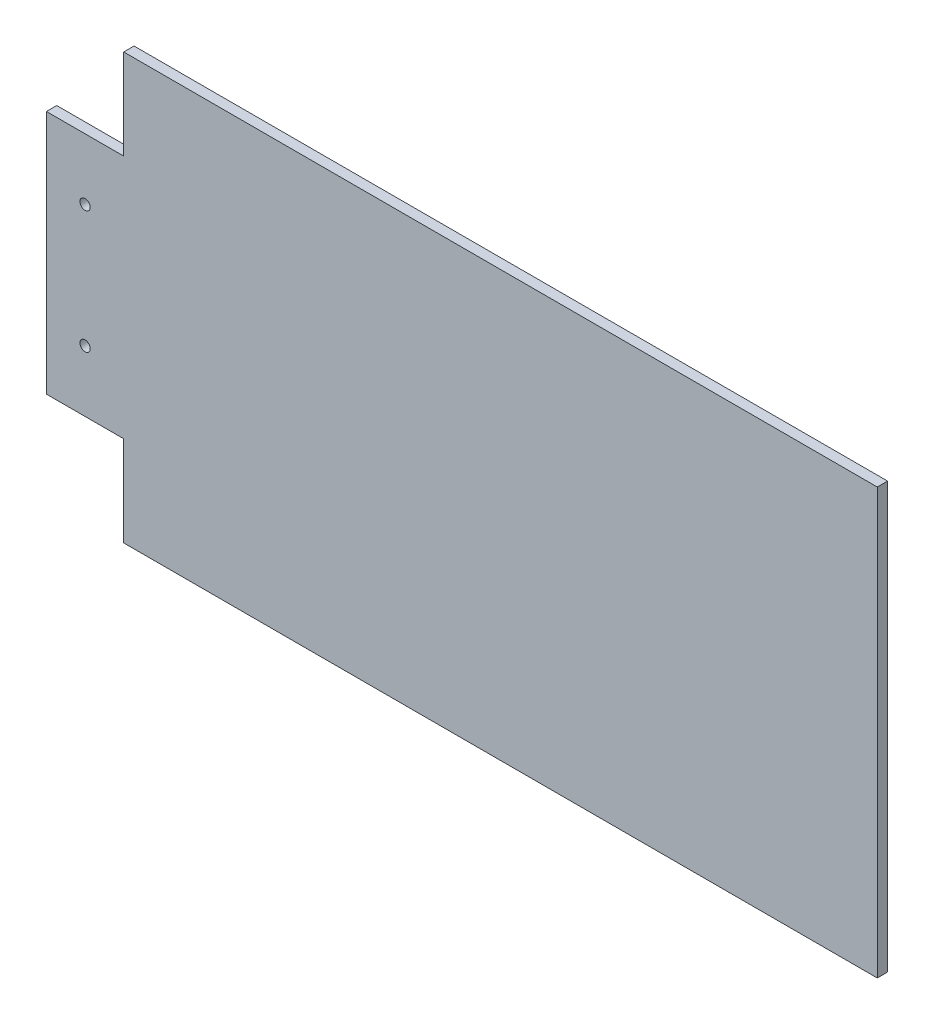
ISO-10303-21;
HEADER;
FILE_DESCRIPTION(('STEP AP214'),'2;1');
FILE_NAME('part.step','',(''),(''),'','','');
FILE_SCHEMA(('AUTOMOTIVE_DESIGN { 1 0 10303 214 1 1 1 1 }'));
ENDSEC;
DATA;
#1=APPLICATION_CONTEXT('core data for automotive mechanical design processes');
#2=APPLICATION_PROTOCOL_DEFINITION('international standard','automotive_design',2000,#1);
#3=PRODUCT_CONTEXT('',#1,'mechanical');
#4=PRODUCT('Part','Part','',(#3));
#5=PRODUCT_RELATED_PRODUCT_CATEGORY('part','',(#4));
#6=PRODUCT_DEFINITION_FORMATION('','',#4);
#7=PRODUCT_DEFINITION_CONTEXT('part definition',#1,'design');
#8=PRODUCT_DEFINITION('design','',#6,#7);
#9=PRODUCT_DEFINITION_SHAPE('','',#8);
#10=(LENGTH_UNIT() NAMED_UNIT(*) SI_UNIT(.MILLI.,.METRE.));
#11=(NAMED_UNIT(*) PLANE_ANGLE_UNIT() SI_UNIT($,.RADIAN.));
#12=(NAMED_UNIT(*) SI_UNIT($,.STERADIAN.) SOLID_ANGLE_UNIT());
#13=UNCERTAINTY_MEASURE_WITH_UNIT(LENGTH_MEASURE(1.E-05),#10,'distance_accuracy_value','');
#14=(GEOMETRIC_REPRESENTATION_CONTEXT(3) GLOBAL_UNCERTAINTY_ASSIGNED_CONTEXT((#13)) GLOBAL_UNIT_ASSIGNED_CONTEXT((#10,
#11,#12)) REPRESENTATION_CONTEXT('',''));
#15=CARTESIAN_POINT('',(0.,0.,0.));
#16=DIRECTION('',(0.,0.,1.));
#17=DIRECTION('',(1.,0.,0.));
#18=AXIS2_PLACEMENT_3D('',#15,#16,#17);
#19=CARTESIAN_POINT('',(0.,0.,4.));
#20=DIRECTION('',(0.,0.,-1.));
#21=DIRECTION('',(-1.,0.,0.));
#22=AXIS2_PLACEMENT_3D('',#19,#20,#21);
#23=PLANE('',#22);
#24=DIRECTION('',(0.,-1.,0.));
#25=VECTOR('',#24,1.);
#26=CARTESIAN_POINT('',(1290.34849584786,1172.22119055081,4.));
#27=LINE('',#26,#25);
#28=CARTESIAN_POINT('',(1290.34849584786,1267.22119061731,4.));
#29=VERTEX_POINT('',#28);
#30=CARTESIAN_POINT('',(1290.34849584786,1172.22119055081,4.));
#31=VERTEX_POINT('',#30);
#32=EDGE_CURVE('E151',#29,#31,#27,.T.);
#33=ORIENTED_EDGE('',*,*,#32,.T.);
#34=DIRECTION('',(1.,0.,0.));
#35=VECTOR('',#34,1.);
#36=CARTESIAN_POINT('',(1290.34849584786,1172.22119055081,4.));
#37=LINE('',#36,#35);
#38=CARTESIAN_POINT('',(1320.34849584661,1172.22119055081,4.));
#39=VERTEX_POINT('',#38);
#40=EDGE_CURVE('E99',#31,#39,#37,.T.);
#41=ORIENTED_EDGE('',*,*,#40,.T.);
#42=DIRECTION('',(0.,-1.,0.));
#43=VECTOR('',#42,1.);
#44=CARTESIAN_POINT('',(1320.34849584661,1172.22119055081,4.));
#45=LINE('',#44,#43);
#46=CARTESIAN_POINT('',(1320.34849584661,1137.22119055081,4.));
#47=VERTEX_POINT('',#46);
#48=EDGE_CURVE('E166',#39,#47,#45,.T.);
#49=ORIENTED_EDGE('',*,*,#48,.T.);
#50=DIRECTION('',(1.,0.,0.));
#51=VECTOR('',#50,1.);
#52=CARTESIAN_POINT('',(1612.7484958616,1137.22119055081,4.));
#53=LINE('',#52,#51);
#54=CARTESIAN_POINT('',(1612.7484958616,1137.22119055081,4.));
#55=VERTEX_POINT('',#54);
#56=EDGE_CURVE('E179',#47,#55,#53,.T.);
#57=ORIENTED_EDGE('',*,*,#56,.T.);
#58=DIRECTION('',(0.,1.,0.));
#59=VECTOR('',#58,1.);
#60=CARTESIAN_POINT('',(1612.7484958616,1302.22119077438,4.));
#61=LINE('',#60,#59);
#62=CARTESIAN_POINT('',(1612.7484958616,1302.22119077438,4.));
#63=VERTEX_POINT('',#62);
#64=EDGE_CURVE('E118',#55,#63,#61,.T.);
#65=ORIENTED_EDGE('',*,*,#64,.T.);
#66=DIRECTION('',(-1.,0.,0.));
#67=VECTOR('',#66,1.);
#68=CARTESIAN_POINT('',(1320.34849584661,1302.22119077438,4.));
#69=LINE('',#68,#67);
#70=CARTESIAN_POINT('',(1320.34849584661,1302.22119077438,4.));
#71=VERTEX_POINT('',#70);
#72=EDGE_CURVE('E112',#63,#71,#69,.T.);
#73=ORIENTED_EDGE('',*,*,#72,.T.);
#74=DIRECTION('',(0.,-1.,0.));
#75=VECTOR('',#74,1.);
#76=CARTESIAN_POINT('',(1320.34849584661,1267.22119061731,4.));
#77=LINE('',#76,#75);
#78=CARTESIAN_POINT('',(1320.34849584661,1267.22119061731,4.));
#79=VERTEX_POINT('',#78);
#80=EDGE_CURVE('E116',#71,#79,#77,.T.);
#81=ORIENTED_EDGE('',*,*,#80,.T.);
#82=DIRECTION('',(-1.,0.,0.));
#83=VECTOR('',#82,1.);
#84=CARTESIAN_POINT('',(1290.34849584786,1267.22119061731,4.));
#85=LINE('',#84,#83);
#86=EDGE_CURVE('E56',#79,#29,#85,.T.);
#87=ORIENTED_EDGE('',*,*,#86,.T.);
#88=EDGE_LOOP('',(#33,#41,#49,#57,#65,#73,#81,#87));
#89=FACE_BOUND('',#88,.T.);
#90=CARTESIAN_POINT('',(1305.34852033572,1243.47119063586,4.));
#91=DIRECTION('',(0.,0.,1.));
#92=DIRECTION('',(1.,0.,0.));
#93=AXIS2_PLACEMENT_3D('',#90,#91,#92);
#94=CIRCLE('',#93,2.0000000000001);
#95=CARTESIAN_POINT('',(1307.34852033572,1243.47119063586,4.));
#96=VERTEX_POINT('',#95);
#97=EDGE_CURVE('E140',#96,#96,#94,.T.);
#98=ORIENTED_EDGE('',*,*,#97,.F.);
#99=EDGE_LOOP('',(#98));
#100=FACE_BOUND('',#99,.T.);
#101=CARTESIAN_POINT('',(1305.34852033584,1195.97119068233,4.));
#102=DIRECTION('',(0.,0.,1.));
#103=DIRECTION('',(1.,0.,0.));
#104=AXIS2_PLACEMENT_3D('',#101,#102,#103);
#105=CIRCLE('',#104,2.0000000000001);
#106=CARTESIAN_POINT('',(1307.34852033584,1195.97119068233,4.));
#107=VERTEX_POINT('',#106);
#108=EDGE_CURVE('E188',#107,#107,#105,.T.);
#109=ORIENTED_EDGE('',*,*,#108,.F.);
#110=EDGE_LOOP('',(#109));
#111=FACE_BOUND('',#110,.T.);
#112=ADVANCED_FACE('F39',(#89,#100,#111),#23,.F.);
#113=CARTESIAN_POINT('',(0.,0.,0.));
#114=DIRECTION('',(0.,0.,-1.));
#115=DIRECTION('',(-1.,0.,0.));
#116=AXIS2_PLACEMENT_3D('',#113,#114,#115);
#117=PLANE('',#116);
#118=CARTESIAN_POINT('',(1305.34852033572,1243.47119063586,0.));
#119=DIRECTION('',(0.,0.,1.));
#120=DIRECTION('',(1.,0.,0.));
#121=AXIS2_PLACEMENT_3D('',#118,#119,#120);
#122=CIRCLE('',#121,2.0000000000001);
#123=CARTESIAN_POINT('',(1307.34852033572,1243.47119063586,0.));
#124=VERTEX_POINT('',#123);
#125=EDGE_CURVE('E185',#124,#124,#122,.T.);
#126=ORIENTED_EDGE('',*,*,#125,.T.);
#127=EDGE_LOOP('',(#126));
#128=FACE_BOUND('',#127,.T.);
#129=DIRECTION('',(0.,-1.,0.));
#130=VECTOR('',#129,1.);
#131=CARTESIAN_POINT('',(1290.34849584786,1172.22119055081,0.));
#132=LINE('',#131,#130);
#133=CARTESIAN_POINT('',(1290.34849584786,1267.22119061731,0.));
#134=VERTEX_POINT('',#133);
#135=CARTESIAN_POINT('',(1290.34849584786,1172.22119055081,0.));
#136=VERTEX_POINT('',#135);
#137=EDGE_CURVE('E136',#134,#136,#132,.T.);
#138=ORIENTED_EDGE('',*,*,#137,.F.);
#139=DIRECTION('',(-1.,0.,0.));
#140=VECTOR('',#139,1.);
#141=CARTESIAN_POINT('',(1290.34849584786,1267.22119061731,0.));
#142=LINE('',#141,#140);
#143=CARTESIAN_POINT('',(1320.34849584661,1267.22119061731,0.));
#144=VERTEX_POINT('',#143);
#145=EDGE_CURVE('E91',#144,#134,#142,.T.);
#146=ORIENTED_EDGE('',*,*,#145,.F.);
#147=DIRECTION('',(0.,-1.,0.));
#148=VECTOR('',#147,1.);
#149=CARTESIAN_POINT('',(1320.34849584661,1267.22119061731,0.));
#150=LINE('',#149,#148);
#151=CARTESIAN_POINT('',(1320.34849584661,1302.22119077438,0.));
#152=VERTEX_POINT('',#151);
#153=EDGE_CURVE('E85',#152,#144,#150,.T.);
#154=ORIENTED_EDGE('',*,*,#153,.F.);
#155=DIRECTION('',(-1.,0.,0.));
#156=VECTOR('',#155,1.);
#157=CARTESIAN_POINT('',(1320.34849584661,1302.22119077438,0.));
#158=LINE('',#157,#156);
#159=CARTESIAN_POINT('',(1612.7484958616,1302.22119077438,0.));
#160=VERTEX_POINT('',#159);
#161=EDGE_CURVE('E126',#160,#152,#158,.T.);
#162=ORIENTED_EDGE('',*,*,#161,.F.);
#163=DIRECTION('',(0.,1.,0.));
#164=VECTOR('',#163,1.);
#165=CARTESIAN_POINT('',(1612.7484958616,1302.22119077438,0.));
#166=LINE('',#165,#164);
#167=CARTESIAN_POINT('',(1612.7484958616,1137.22119055081,0.));
#168=VERTEX_POINT('',#167);
#169=EDGE_CURVE('E146',#168,#160,#166,.T.);
#170=ORIENTED_EDGE('',*,*,#169,.F.);
#171=DIRECTION('',(1.,0.,0.));
#172=VECTOR('',#171,1.);
#173=CARTESIAN_POINT('',(1612.7484958616,1137.22119055081,0.));
#174=LINE('',#173,#172);
#175=CARTESIAN_POINT('',(1320.34849584661,1137.22119055081,0.));
#176=VERTEX_POINT('',#175);
#177=EDGE_CURVE('E144',#176,#168,#174,.T.);
#178=ORIENTED_EDGE('',*,*,#177,.F.);
#179=DIRECTION('',(0.,-1.,0.));
#180=VECTOR('',#179,1.);
#181=CARTESIAN_POINT('',(1320.34849584661,1172.22119055081,0.));
#182=LINE('',#181,#180);
#183=CARTESIAN_POINT('',(1320.34849584661,1172.22119055081,0.));
#184=VERTEX_POINT('',#183);
#185=EDGE_CURVE('E142',#184,#176,#182,.T.);
#186=ORIENTED_EDGE('',*,*,#185,.F.);
#187=DIRECTION('',(1.,0.,0.));
#188=VECTOR('',#187,1.);
#189=CARTESIAN_POINT('',(1290.34849584786,1172.22119055081,0.));
#190=LINE('',#189,#188);
#191=EDGE_CURVE('E139',#136,#184,#190,.T.);
#192=ORIENTED_EDGE('',*,*,#191,.F.);
#193=EDGE_LOOP('',(#138,#146,#154,#162,#170,#178,#186,#192));
#194=FACE_BOUND('',#193,.T.);
#195=CARTESIAN_POINT('',(1305.34852033584,1195.97119068233,0.));
#196=DIRECTION('',(0.,0.,1.));
#197=DIRECTION('',(1.,0.,0.));
#198=AXIS2_PLACEMENT_3D('',#195,#196,#197);
#199=CIRCLE('',#198,2.0000000000001);
#200=CARTESIAN_POINT('',(1307.34852033584,1195.97119068233,0.));
#201=VERTEX_POINT('',#200);
#202=EDGE_CURVE('E191',#201,#201,#199,.T.);
#203=ORIENTED_EDGE('',*,*,#202,.T.);
#204=EDGE_LOOP('',(#203));
#205=FACE_BOUND('',#204,.T.);
#206=ADVANCED_FACE('F170',(#128,#194,#205),#117,.T.);
#207=CARTESIAN_POINT('',(1290.34849584786,1172.22119055081,4.));
#208=DIRECTION('',(1.,0.,0.));
#209=DIRECTION('',(0.,0.,-1.));
#210=AXIS2_PLACEMENT_3D('',#207,#208,#209);
#211=PLANE('',#210);
#212=ORIENTED_EDGE('',*,*,#137,.T.);
#213=DIRECTION('',(0.,0.,-1.));
#214=VECTOR('',#213,1.);
#215=CARTESIAN_POINT('',(1290.34849584786,1172.22119055081,4.));
#216=LINE('',#215,#214);
#217=EDGE_CURVE('E11',#31,#136,#216,.T.);
#218=ORIENTED_EDGE('',*,*,#217,.F.);
#219=ORIENTED_EDGE('',*,*,#32,.F.);
#220=DIRECTION('',(0.,0.,-1.));
#221=VECTOR('',#220,1.);
#222=CARTESIAN_POINT('',(1290.34849584786,1267.22119061731,4.));
#223=LINE('',#222,#221);
#224=EDGE_CURVE('E132',#29,#134,#223,.T.);
#225=ORIENTED_EDGE('',*,*,#224,.T.);
#226=EDGE_LOOP('',(#212,#218,#219,#225));
#227=FACE_BOUND('',#226,.T.);
#228=ADVANCED_FACE('F41',(#227),#211,.F.);
#229=CARTESIAN_POINT('',(1290.34849584786,1172.22119055081,4.));
#230=DIRECTION('',(0.,1.,0.));
#231=DIRECTION('',(0.,0.,1.));
#232=AXIS2_PLACEMENT_3D('',#229,#230,#231);
#233=PLANE('',#232);
#234=ORIENTED_EDGE('',*,*,#191,.T.);
#235=DIRECTION('',(0.,0.,-1.));
#236=VECTOR('',#235,1.);
#237=CARTESIAN_POINT('',(1320.34849584661,1172.22119055081,4.));
#238=LINE('',#237,#236);
#239=EDGE_CURVE('E48',#39,#184,#238,.T.);
#240=ORIENTED_EDGE('',*,*,#239,.F.);
#241=ORIENTED_EDGE('',*,*,#40,.F.);
#242=ORIENTED_EDGE('',*,*,#217,.T.);
#243=EDGE_LOOP('',(#234,#240,#241,#242));
#244=FACE_BOUND('',#243,.T.);
#245=ADVANCED_FACE('F223',(#244),#233,.F.);
#246=CARTESIAN_POINT('',(1320.34849584661,1172.22119055081,4.));
#247=DIRECTION('',(1.,0.,0.));
#248=DIRECTION('',(0.,0.,-1.));
#249=AXIS2_PLACEMENT_3D('',#246,#247,#248);
#250=PLANE('',#249);
#251=ORIENTED_EDGE('',*,*,#185,.T.);
#252=DIRECTION('',(0.,0.,-1.));
#253=VECTOR('',#252,1.);
#254=CARTESIAN_POINT('',(1320.34849584661,1137.22119055081,4.));
#255=LINE('',#254,#253);
#256=EDGE_CURVE('E158',#47,#176,#255,.T.);
#257=ORIENTED_EDGE('',*,*,#256,.F.);
#258=ORIENTED_EDGE('',*,*,#48,.F.);
#259=ORIENTED_EDGE('',*,*,#239,.T.);
#260=EDGE_LOOP('',(#251,#257,#258,#259));
#261=FACE_BOUND('',#260,.T.);
#262=ADVANCED_FACE('F164',(#261),#250,.F.);
#263=CARTESIAN_POINT('',(1612.7484958616,1137.22119055081,4.));
#264=DIRECTION('',(0.,1.,0.));
#265=DIRECTION('',(0.,0.,1.));
#266=AXIS2_PLACEMENT_3D('',#263,#264,#265);
#267=PLANE('',#266);
#268=ORIENTED_EDGE('',*,*,#177,.T.);
#269=DIRECTION('',(0.,0.,-1.));
#270=VECTOR('',#269,1.);
#271=CARTESIAN_POINT('',(1612.7484958616,1137.22119055081,4.));
#272=LINE('',#271,#270);
#273=EDGE_CURVE('E155',#55,#168,#272,.T.);
#274=ORIENTED_EDGE('',*,*,#273,.F.);
#275=ORIENTED_EDGE('',*,*,#56,.F.);
#276=ORIENTED_EDGE('',*,*,#256,.T.);
#277=EDGE_LOOP('',(#268,#274,#275,#276));
#278=FACE_BOUND('',#277,.T.);
#279=ADVANCED_FACE('F175',(#278),#267,.F.);
#280=CARTESIAN_POINT('',(1612.7484958616,1302.22119077438,4.));
#281=DIRECTION('',(-1.,0.,0.));
#282=DIRECTION('',(0.,0.,1.));
#283=AXIS2_PLACEMENT_3D('',#280,#281,#282);
#284=PLANE('',#283);
#285=ORIENTED_EDGE('',*,*,#169,.T.);
#286=DIRECTION('',(0.,0.,-1.));
#287=VECTOR('',#286,1.);
#288=CARTESIAN_POINT('',(1612.7484958616,1302.22119077438,4.));
#289=LINE('',#288,#287);
#290=EDGE_CURVE('E127',#63,#160,#289,.T.);
#291=ORIENTED_EDGE('',*,*,#290,.F.);
#292=ORIENTED_EDGE('',*,*,#64,.F.);
#293=ORIENTED_EDGE('',*,*,#273,.T.);
#294=EDGE_LOOP('',(#285,#291,#292,#293));
#295=FACE_BOUND('',#294,.T.);
#296=ADVANCED_FACE('F178',(#295),#284,.F.);
#297=CARTESIAN_POINT('',(1320.34849584661,1302.22119077438,4.));
#298=DIRECTION('',(0.,-1.,0.));
#299=DIRECTION('',(0.,0.,-1.));
#300=AXIS2_PLACEMENT_3D('',#297,#298,#299);
#301=PLANE('',#300);
#302=ORIENTED_EDGE('',*,*,#161,.T.);
#303=DIRECTION('',(0.,0.,-1.));
#304=VECTOR('',#303,1.);
#305=CARTESIAN_POINT('',(1320.34849584661,1302.22119077438,4.));
#306=LINE('',#305,#304);
#307=EDGE_CURVE('E123',#71,#152,#306,.T.);
#308=ORIENTED_EDGE('',*,*,#307,.F.);
#309=ORIENTED_EDGE('',*,*,#72,.F.);
#310=ORIENTED_EDGE('',*,*,#290,.T.);
#311=EDGE_LOOP('',(#302,#308,#309,#310));
#312=FACE_BOUND('',#311,.T.);
#313=ADVANCED_FACE('F124',(#312),#301,.F.);
#314=CARTESIAN_POINT('',(1320.34849584661,1267.22119061731,4.));
#315=DIRECTION('',(1.,0.,0.));
#316=DIRECTION('',(0.,0.,-1.));
#317=AXIS2_PLACEMENT_3D('',#314,#315,#316);
#318=PLANE('',#317);
#319=ORIENTED_EDGE('',*,*,#153,.T.);
#320=DIRECTION('',(0.,0.,-1.));
#321=VECTOR('',#320,1.);
#322=CARTESIAN_POINT('',(1320.34849584661,1267.22119061731,4.));
#323=LINE('',#322,#321);
#324=EDGE_CURVE('E128',#79,#144,#323,.T.);
#325=ORIENTED_EDGE('',*,*,#324,.F.);
#326=ORIENTED_EDGE('',*,*,#80,.F.);
#327=ORIENTED_EDGE('',*,*,#307,.T.);
#328=EDGE_LOOP('',(#319,#325,#326,#327));
#329=FACE_BOUND('',#328,.T.);
#330=ADVANCED_FACE('F130',(#329),#318,.F.);
#331=CARTESIAN_POINT('',(1290.34849584786,1267.22119061731,4.));
#332=DIRECTION('',(0.,-1.,0.));
#333=DIRECTION('',(0.,0.,-1.));
#334=AXIS2_PLACEMENT_3D('',#331,#332,#333);
#335=PLANE('',#334);
#336=ORIENTED_EDGE('',*,*,#145,.T.);
#337=ORIENTED_EDGE('',*,*,#224,.F.);
#338=ORIENTED_EDGE('',*,*,#86,.F.);
#339=ORIENTED_EDGE('',*,*,#324,.T.);
#340=EDGE_LOOP('',(#336,#337,#338,#339));
#341=FACE_BOUND('',#340,.T.);
#342=ADVANCED_FACE('F211',(#341),#335,.F.);
#343=CARTESIAN_POINT('',(1305.34852033572,1243.47119063586,4.));
#344=DIRECTION('',(0.,0.,-1.));
#345=DIRECTION('',(-1.,0.,0.));
#346=AXIS2_PLACEMENT_3D('',#343,#344,#345);
#347=CYLINDRICAL_SURFACE('',#346,2.0000000000001);
#348=ORIENTED_EDGE('',*,*,#97,.T.);
#349=EDGE_LOOP('',(#348));
#350=FACE_BOUND('',#349,.T.);
#351=ORIENTED_EDGE('',*,*,#125,.F.);
#352=EDGE_LOOP('',(#351));
#353=FACE_BOUND('',#352,.T.);
#354=ADVANCED_FACE('F208',(#350,#353),#347,.F.);
#355=CARTESIAN_POINT('',(1305.34852033584,1195.97119068233,4.));
#356=DIRECTION('',(0.,0.,-1.));
#357=DIRECTION('',(-1.,0.,0.));
#358=AXIS2_PLACEMENT_3D('',#355,#356,#357);
#359=CYLINDRICAL_SURFACE('',#358,2.0000000000001);
#360=ORIENTED_EDGE('',*,*,#108,.T.);
#361=EDGE_LOOP('',(#360));
#362=FACE_BOUND('',#361,.T.);
#363=ORIENTED_EDGE('',*,*,#202,.F.);
#364=EDGE_LOOP('',(#363));
#365=FACE_BOUND('',#364,.T.);
#366=ADVANCED_FACE('F197',(#362,#365),#359,.F.);
#367=CLOSED_SHELL('',(#112,#206,#228,#245,#262,#279,#296,#313,#330,#342,#354,#366));
#368=MANIFOLD_SOLID_BREP('B2',#367);
#369=ADVANCED_BREP_SHAPE_REPRESENTATION('',(#18,#368),#14);
#370=SHAPE_DEFINITION_REPRESENTATION(#9,#369);
ENDSEC;
END-ISO-10303-21;
